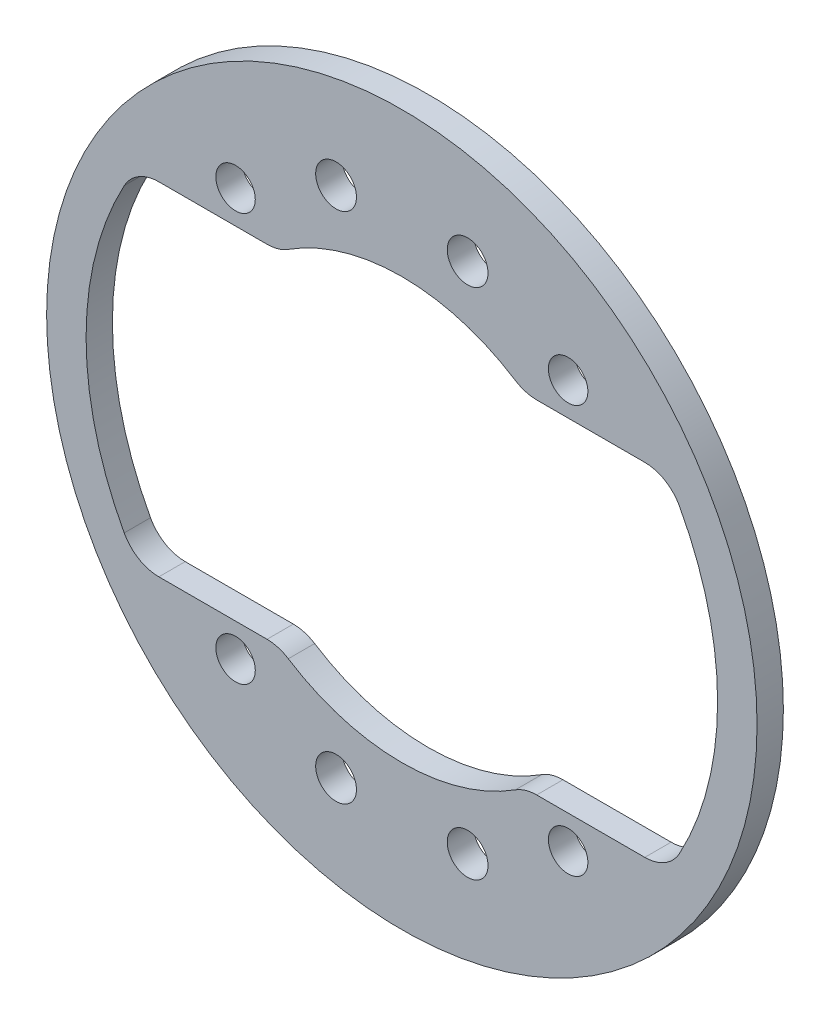
ISO-10303-21;
HEADER;
FILE_DESCRIPTION(('STEP AP214'),'2;1');
FILE_NAME('part.step','',(''),(''),'','','');
FILE_SCHEMA(('AUTOMOTIVE_DESIGN { 1 0 10303 214 1 1 1 1 }'));
ENDSEC;
DATA;
#1=APPLICATION_CONTEXT('core data for automotive mechanical design processes');
#2=APPLICATION_PROTOCOL_DEFINITION('international standard','automotive_design',2000,#1);
#3=PRODUCT_CONTEXT('',#1,'mechanical');
#4=PRODUCT('Part','Part','',(#3));
#5=PRODUCT_RELATED_PRODUCT_CATEGORY('part','',(#4));
#6=PRODUCT_DEFINITION_FORMATION('','',#4);
#7=PRODUCT_DEFINITION_CONTEXT('part definition',#1,'design');
#8=PRODUCT_DEFINITION('design','',#6,#7);
#9=PRODUCT_DEFINITION_SHAPE('','',#8);
#10=(LENGTH_UNIT() NAMED_UNIT(*) SI_UNIT(.MILLI.,.METRE.));
#11=(NAMED_UNIT(*) PLANE_ANGLE_UNIT() SI_UNIT($,.RADIAN.));
#12=(NAMED_UNIT(*) SI_UNIT($,.STERADIAN.) SOLID_ANGLE_UNIT());
#13=UNCERTAINTY_MEASURE_WITH_UNIT(LENGTH_MEASURE(1.E-05),#10,'distance_accuracy_value','');
#14=(GEOMETRIC_REPRESENTATION_CONTEXT(3) GLOBAL_UNCERTAINTY_ASSIGNED_CONTEXT((#13)) GLOBAL_UNIT_ASSIGNED_CONTEXT((#10,
#11,#12)) REPRESENTATION_CONTEXT('',''));
#15=CARTESIAN_POINT('',(0.,0.,0.));
#16=DIRECTION('',(0.,0.,1.));
#17=DIRECTION('',(1.,0.,0.));
#18=AXIS2_PLACEMENT_3D('',#15,#16,#17);
#19=CARTESIAN_POINT('',(0.,0.,1.));
#20=DIRECTION('',(0.,0.,1.));
#21=DIRECTION('',(1.,0.,0.));
#22=AXIS2_PLACEMENT_3D('',#19,#20,#21);
#23=PLANE('',#22);
#24=CARTESIAN_POINT('',(-5.,-19.5,1.));
#25=DIRECTION('',(0.,0.,1.));
#26=DIRECTION('',(1.,0.,0.));
#27=AXIS2_PLACEMENT_3D('',#24,#25,#26);
#28=CIRCLE('',#27,1.55);
#29=CARTESIAN_POINT('',(-3.45,-19.5,1.));
#30=VERTEX_POINT('',#29);
#31=EDGE_CURVE('E593',#30,#30,#28,.T.);
#32=ORIENTED_EDGE('',*,*,#31,.F.);
#33=EDGE_LOOP('',(#32));
#34=FACE_BOUND('',#33,.T.);
#35=CARTESIAN_POINT('',(5.,19.5,1.));
#36=DIRECTION('',(0.,0.,1.));
#37=DIRECTION('',(1.,0.,0.));
#38=AXIS2_PLACEMENT_3D('',#35,#36,#37);
#39=CIRCLE('',#38,1.55);
#40=CARTESIAN_POINT('',(6.55,19.5,1.));
#41=VERTEX_POINT('',#40);
#42=EDGE_CURVE('E595',#41,#41,#39,.T.);
#43=ORIENTED_EDGE('',*,*,#42,.F.);
#44=EDGE_LOOP('',(#43));
#45=FACE_BOUND('',#44,.T.);
#46=CARTESIAN_POINT('',(5.,-19.5,1.));
#47=DIRECTION('',(0.,0.,1.));
#48=DIRECTION('',(1.,0.,0.));
#49=AXIS2_PLACEMENT_3D('',#46,#47,#48);
#50=CIRCLE('',#49,1.55);
#51=CARTESIAN_POINT('',(6.55,-19.5,1.));
#52=VERTEX_POINT('',#51);
#53=EDGE_CURVE('E606',#52,#52,#50,.T.);
#54=ORIENTED_EDGE('',*,*,#53,.F.);
#55=EDGE_LOOP('',(#54));
#56=FACE_BOUND('',#55,.T.);
#57=CARTESIAN_POINT('',(-5.,19.5,1.));
#58=DIRECTION('',(0.,0.,1.));
#59=DIRECTION('',(1.,0.,0.));
#60=AXIS2_PLACEMENT_3D('',#57,#58,#59);
#61=CIRCLE('',#60,1.55);
#62=CARTESIAN_POINT('',(-3.45,19.5,1.));
#63=VERTEX_POINT('',#62);
#64=EDGE_CURVE('E373',#63,#63,#61,.T.);
#65=ORIENTED_EDGE('',*,*,#64,.F.);
#66=EDGE_LOOP('',(#65));
#67=FACE_BOUND('',#66,.T.);
#68=CARTESIAN_POINT('',(-12.6392246597645,-15.5,1.));
#69=DIRECTION('',(0.,0.,1.));
#70=DIRECTION('',(1.,0.,0.));
#71=AXIS2_PLACEMENT_3D('',#68,#69,#70);
#72=CIRCLE('',#71,1.5);
#73=CARTESIAN_POINT('',(-11.1392246597645,-15.5,1.));
#74=VERTEX_POINT('',#73);
#75=EDGE_CURVE('E290',#74,#74,#72,.T.);
#76=ORIENTED_EDGE('',*,*,#75,.F.);
#77=EDGE_LOOP('',(#76));
#78=FACE_BOUND('',#77,.T.);
#79=CARTESIAN_POINT('',(-12.6392246597645,15.5,1.));
#80=DIRECTION('',(0.,0.,1.));
#81=DIRECTION('',(1.,0.,0.));
#82=AXIS2_PLACEMENT_3D('',#79,#80,#81);
#83=CIRCLE('',#82,1.5);
#84=CARTESIAN_POINT('',(-11.1392246597645,15.5,1.));
#85=VERTEX_POINT('',#84);
#86=EDGE_CURVE('E302',#85,#85,#83,.T.);
#87=ORIENTED_EDGE('',*,*,#86,.F.);
#88=EDGE_LOOP('',(#87));
#89=FACE_BOUND('',#88,.T.);
#90=CARTESIAN_POINT('',(0.,0.,1.));
#91=DIRECTION('',(0.,0.,1.));
#92=DIRECTION('',(1.,0.,0.));
#93=AXIS2_PLACEMENT_3D('',#90,#91,#92);
#94=CIRCLE('',#93,27.);
#95=CARTESIAN_POINT('',(27.,0.,1.));
#96=VERTEX_POINT('',#95);
#97=EDGE_CURVE('E175',#96,#96,#94,.T.);
#98=ORIENTED_EDGE('',*,*,#97,.T.);
#99=EDGE_LOOP('',(#98));
#100=FACE_BOUND('',#99,.T.);
#101=CARTESIAN_POINT('',(12.6392246597645,15.5,1.));
#102=DIRECTION('',(0.,0.,1.));
#103=DIRECTION('',(1.,0.,0.));
#104=AXIS2_PLACEMENT_3D('',#101,#102,#103);
#105=CIRCLE('',#104,1.5);
#106=CARTESIAN_POINT('',(14.1392246597645,15.5,1.));
#107=VERTEX_POINT('',#106);
#108=EDGE_CURVE('E296',#107,#107,#105,.T.);
#109=ORIENTED_EDGE('',*,*,#108,.F.);
#110=EDGE_LOOP('',(#109));
#111=FACE_BOUND('',#110,.T.);
#112=CARTESIAN_POINT('',(12.6392246597645,-15.5,1.));
#113=DIRECTION('',(0.,0.,1.));
#114=DIRECTION('',(1.,0.,0.));
#115=AXIS2_PLACEMENT_3D('',#112,#113,#114);
#116=CIRCLE('',#115,1.5);
#117=CARTESIAN_POINT('',(14.1392246597645,-15.5,1.));
#118=VERTEX_POINT('',#117);
#119=EDGE_CURVE('E267',#118,#118,#116,.T.);
#120=ORIENTED_EDGE('',*,*,#119,.F.);
#121=EDGE_LOOP('',(#120));
#122=FACE_BOUND('',#121,.T.);
#123=DIRECTION('',(1.,0.,0.));
#124=VECTOR('',#123,1.);
#125=CARTESIAN_POINT('',(9.32737905308881,-13.,1.));
#126=LINE('',#125,#124);
#127=CARTESIAN_POINT('',(10.2469507659596,-13.,1.));
#128=VERTEX_POINT('',#127);
#129=CARTESIAN_POINT('',(18.4661853126194,-13.,1.));
#130=VERTEX_POINT('',#129);
#131=EDGE_CURVE('E377',#128,#130,#126,.T.);
#132=ORIENTED_EDGE('',*,*,#131,.F.);
#133=CARTESIAN_POINT('',(10.2469507659596,-16.,1.));
#134=DIRECTION('',(0.,0.,1.));
#135=DIRECTION('',(1.,0.,0.));
#136=AXIS2_PLACEMENT_3D('',#133,#134,#135);
#137=CIRCLE('',#136,3.);
#138=CARTESIAN_POINT('',(8.62901117133439,-13.4736842105263,1.));
#139=VERTEX_POINT('',#138);
#140=EDGE_CURVE('E197',#128,#139,#137,.T.);
#141=ORIENTED_EDGE('',*,*,#140,.T.);
#142=CARTESIAN_POINT('',(0.,0.,1.));
#143=DIRECTION('',(0.,0.,1.));
#144=DIRECTION('',(1.,0.,0.));
#145=AXIS2_PLACEMENT_3D('',#142,#143,#144);
#146=CIRCLE('',#145,16.);
#147=CARTESIAN_POINT('',(-8.62901117133439,-13.4736842105263,1.));
#148=VERTEX_POINT('',#147);
#149=EDGE_CURVE('E370',#148,#139,#146,.T.);
#150=ORIENTED_EDGE('',*,*,#149,.F.);
#151=CARTESIAN_POINT('',(-10.2469507659596,-16.,1.));
#152=DIRECTION('',(0.,0.,1.));
#153=DIRECTION('',(1.,0.,0.));
#154=AXIS2_PLACEMENT_3D('',#151,#152,#153);
#155=CIRCLE('',#154,3.);
#156=CARTESIAN_POINT('',(-10.2469507659596,-13.,1.));
#157=VERTEX_POINT('',#156);
#158=EDGE_CURVE('E174',#148,#157,#155,.T.);
#159=ORIENTED_EDGE('',*,*,#158,.T.);
#160=DIRECTION('',(1.,0.,0.));
#161=VECTOR('',#160,1.);
#162=CARTESIAN_POINT('',(-20.174241001832,-13.,1.));
#163=LINE('',#162,#161);
#164=CARTESIAN_POINT('',(-18.4661853126194,-13.,1.));
#165=VERTEX_POINT('',#164);
#166=EDGE_CURVE('E368',#165,#157,#163,.T.);
#167=ORIENTED_EDGE('',*,*,#166,.F.);
#168=CARTESIAN_POINT('',(-18.4661853126194,-10.,1.));
#169=DIRECTION('',(0.,0.,1.));
#170=DIRECTION('',(1.,0.,0.));
#171=AXIS2_PLACEMENT_3D('',#168,#169,#170);
#172=CIRCLE('',#171,3.);
#173=CARTESIAN_POINT('',(-21.1042117858507,-11.4285714285714,1.));
#174=VERTEX_POINT('',#173);
#175=EDGE_CURVE('E236',#165,#174,#172,.F.);
#176=ORIENTED_EDGE('',*,*,#175,.T.);
#177=CARTESIAN_POINT('',(0.,0.,1.));
#178=DIRECTION('',(0.,0.,1.));
#179=DIRECTION('',(1.,0.,0.));
#180=AXIS2_PLACEMENT_3D('',#177,#178,#179);
#181=CIRCLE('',#180,24.0000000000001);
#182=CARTESIAN_POINT('',(-21.1042117858507,11.4285714285714,1.));
#183=VERTEX_POINT('',#182);
#184=EDGE_CURVE('E259',#183,#174,#181,.T.);
#185=ORIENTED_EDGE('',*,*,#184,.F.);
#186=CARTESIAN_POINT('',(-18.4661853126194,10.,1.));
#187=DIRECTION('',(0.,0.,1.));
#188=DIRECTION('',(1.,0.,0.));
#189=AXIS2_PLACEMENT_3D('',#186,#187,#188);
#190=CIRCLE('',#189,3.);
#191=CARTESIAN_POINT('',(-18.4661853126194,13.,1.));
#192=VERTEX_POINT('',#191);
#193=EDGE_CURVE('E11',#183,#192,#190,.F.);
#194=ORIENTED_EDGE('',*,*,#193,.T.);
#195=DIRECTION('',(-1.,0.,0.));
#196=VECTOR('',#195,1.);
#197=CARTESIAN_POINT('',(-20.174241001832,13.,1.));
#198=LINE('',#197,#196);
#199=CARTESIAN_POINT('',(-10.2469507659596,13.,1.));
#200=VERTEX_POINT('',#199);
#201=EDGE_CURVE('E257',#200,#192,#198,.T.);
#202=ORIENTED_EDGE('',*,*,#201,.F.);
#203=CARTESIAN_POINT('',(-10.2469507659596,16.,1.));
#204=DIRECTION('',(0.,0.,1.));
#205=DIRECTION('',(1.,0.,0.));
#206=AXIS2_PLACEMENT_3D('',#203,#204,#205);
#207=CIRCLE('',#206,3.);
#208=CARTESIAN_POINT('',(-8.62901117133439,13.4736842105263,1.));
#209=VERTEX_POINT('',#208);
#210=EDGE_CURVE('E194',#200,#209,#207,.T.);
#211=ORIENTED_EDGE('',*,*,#210,.T.);
#212=CARTESIAN_POINT('',(0.,0.,1.));
#213=DIRECTION('',(0.,0.,1.));
#214=DIRECTION('',(1.,0.,0.));
#215=AXIS2_PLACEMENT_3D('',#212,#213,#214);
#216=CIRCLE('',#215,16.);
#217=CARTESIAN_POINT('',(8.62901117133439,13.4736842105263,1.));
#218=VERTEX_POINT('',#217);
#219=EDGE_CURVE('E264',#218,#209,#216,.T.);
#220=ORIENTED_EDGE('',*,*,#219,.F.);
#221=CARTESIAN_POINT('',(10.2469507659596,16.,1.));
#222=DIRECTION('',(0.,0.,1.));
#223=DIRECTION('',(1.,0.,0.));
#224=AXIS2_PLACEMENT_3D('',#221,#222,#223);
#225=CIRCLE('',#224,3.);
#226=CARTESIAN_POINT('',(10.2469507659596,13.,1.));
#227=VERTEX_POINT('',#226);
#228=EDGE_CURVE('E192',#218,#227,#225,.T.);
#229=ORIENTED_EDGE('',*,*,#228,.T.);
#230=DIRECTION('',(-1.,0.,0.));
#231=VECTOR('',#230,1.);
#232=CARTESIAN_POINT('',(9.32737905308881,13.,1.));
#233=LINE('',#232,#231);
#234=CARTESIAN_POINT('',(18.4661853126194,13.,1.));
#235=VERTEX_POINT('',#234);
#236=EDGE_CURVE('E270',#235,#227,#233,.T.);
#237=ORIENTED_EDGE('',*,*,#236,.F.);
#238=CARTESIAN_POINT('',(18.4661853126194,10.,1.));
#239=DIRECTION('',(0.,0.,1.));
#240=DIRECTION('',(1.,0.,0.));
#241=AXIS2_PLACEMENT_3D('',#238,#239,#240);
#242=CIRCLE('',#241,3.);
#243=CARTESIAN_POINT('',(21.1042117858507,11.4285714285714,1.));
#244=VERTEX_POINT('',#243);
#245=EDGE_CURVE('E50',#235,#244,#242,.F.);
#246=ORIENTED_EDGE('',*,*,#245,.T.);
#247=CARTESIAN_POINT('',(0.,0.,1.));
#248=DIRECTION('',(0.,0.,1.));
#249=DIRECTION('',(-1.,0.,0.));
#250=AXIS2_PLACEMENT_3D('',#247,#248,#249);
#251=CIRCLE('',#250,24.);
#252=CARTESIAN_POINT('',(21.1042117858507,-11.4285714285714,1.));
#253=VERTEX_POINT('',#252);
#254=EDGE_CURVE('E380',#253,#244,#251,.T.);
#255=ORIENTED_EDGE('',*,*,#254,.F.);
#256=CARTESIAN_POINT('',(18.4661853126194,-10.,1.));
#257=DIRECTION('',(0.,0.,1.));
#258=DIRECTION('',(1.,0.,0.));
#259=AXIS2_PLACEMENT_3D('',#256,#257,#258);
#260=CIRCLE('',#259,3.);
#261=EDGE_CURVE('E232',#253,#130,#260,.F.);
#262=ORIENTED_EDGE('',*,*,#261,.T.);
#263=EDGE_LOOP('',(#132,#141,#150,#159,#167,#176,#185,#194,#202,#211,#220,#229,#237,#246,#255,#262));
#264=FACE_BOUND('',#263,.T.);
#265=ADVANCED_FACE('F35',(#34,#45,#56,#67,#78,#89,#100,#111,#122,#264),#23,.T.);
#266=CARTESIAN_POINT('',(0.,0.,-1.));
#267=DIRECTION('',(0.,0.,1.));
#268=DIRECTION('',(1.,0.,0.));
#269=AXIS2_PLACEMENT_3D('',#266,#267,#268);
#270=PLANE('',#269);
#271=CARTESIAN_POINT('',(-5.,-19.5,-1.));
#272=DIRECTION('',(0.,0.,1.));
#273=DIRECTION('',(1.,0.,0.));
#274=AXIS2_PLACEMENT_3D('',#271,#272,#273);
#275=CIRCLE('',#274,1.55);
#276=CARTESIAN_POINT('',(-3.45,-19.5,-1.));
#277=VERTEX_POINT('',#276);
#278=EDGE_CURVE('E591',#277,#277,#275,.T.);
#279=ORIENTED_EDGE('',*,*,#278,.T.);
#280=EDGE_LOOP('',(#279));
#281=FACE_BOUND('',#280,.T.);
#282=CARTESIAN_POINT('',(5.,19.5,-1.));
#283=DIRECTION('',(0.,0.,1.));
#284=DIRECTION('',(1.,0.,0.));
#285=AXIS2_PLACEMENT_3D('',#282,#283,#284);
#286=CIRCLE('',#285,1.55);
#287=CARTESIAN_POINT('',(6.55,19.5,-1.));
#288=VERTEX_POINT('',#287);
#289=EDGE_CURVE('E611',#288,#288,#286,.T.);
#290=ORIENTED_EDGE('',*,*,#289,.T.);
#291=EDGE_LOOP('',(#290));
#292=FACE_BOUND('',#291,.T.);
#293=CARTESIAN_POINT('',(5.,-19.5,-1.));
#294=DIRECTION('',(0.,0.,1.));
#295=DIRECTION('',(1.,0.,0.));
#296=AXIS2_PLACEMENT_3D('',#293,#294,#295);
#297=CIRCLE('',#296,1.55);
#298=CARTESIAN_POINT('',(6.55,-19.5,-1.));
#299=VERTEX_POINT('',#298);
#300=EDGE_CURVE('E602',#299,#299,#297,.T.);
#301=ORIENTED_EDGE('',*,*,#300,.T.);
#302=EDGE_LOOP('',(#301));
#303=FACE_BOUND('',#302,.T.);
#304=CARTESIAN_POINT('',(-5.,19.5,-1.));
#305=DIRECTION('',(0.,0.,1.));
#306=DIRECTION('',(1.,0.,0.));
#307=AXIS2_PLACEMENT_3D('',#304,#305,#306);
#308=CIRCLE('',#307,1.55);
#309=CARTESIAN_POINT('',(-3.45,19.5,-1.));
#310=VERTEX_POINT('',#309);
#311=EDGE_CURVE('E251',#310,#310,#308,.T.);
#312=ORIENTED_EDGE('',*,*,#311,.T.);
#313=EDGE_LOOP('',(#312));
#314=FACE_BOUND('',#313,.T.);
#315=CARTESIAN_POINT('',(12.6392246597645,-15.5,-1.));
#316=DIRECTION('',(0.,0.,1.));
#317=DIRECTION('',(1.,0.,0.));
#318=AXIS2_PLACEMENT_3D('',#315,#316,#317);
#319=CIRCLE('',#318,1.5);
#320=CARTESIAN_POINT('',(14.1392246597645,-15.5,-1.));
#321=VERTEX_POINT('',#320);
#322=EDGE_CURVE('E263',#321,#321,#319,.T.);
#323=ORIENTED_EDGE('',*,*,#322,.T.);
#324=EDGE_LOOP('',(#323));
#325=FACE_BOUND('',#324,.T.);
#326=CARTESIAN_POINT('',(-12.6392246597645,-15.5,-1.));
#327=DIRECTION('',(0.,0.,1.));
#328=DIRECTION('',(1.,0.,0.));
#329=AXIS2_PLACEMENT_3D('',#326,#327,#328);
#330=CIRCLE('',#329,1.5);
#331=CARTESIAN_POINT('',(-11.1392246597645,-15.5,-1.));
#332=VERTEX_POINT('',#331);
#333=EDGE_CURVE('E288',#332,#332,#330,.T.);
#334=ORIENTED_EDGE('',*,*,#333,.T.);
#335=EDGE_LOOP('',(#334));
#336=FACE_BOUND('',#335,.T.);
#337=CARTESIAN_POINT('',(12.6392246597645,15.5,-1.));
#338=DIRECTION('',(0.,0.,1.));
#339=DIRECTION('',(1.,0.,0.));
#340=AXIS2_PLACEMENT_3D('',#337,#338,#339);
#341=CIRCLE('',#340,1.5);
#342=CARTESIAN_POINT('',(14.1392246597645,15.5,-1.));
#343=VERTEX_POINT('',#342);
#344=EDGE_CURVE('E293',#343,#343,#341,.T.);
#345=ORIENTED_EDGE('',*,*,#344,.T.);
#346=EDGE_LOOP('',(#345));
#347=FACE_BOUND('',#346,.T.);
#348=CARTESIAN_POINT('',(-12.6392246597645,15.5,-1.));
#349=DIRECTION('',(0.,0.,1.));
#350=DIRECTION('',(1.,0.,0.));
#351=AXIS2_PLACEMENT_3D('',#348,#349,#350);
#352=CIRCLE('',#351,1.5);
#353=CARTESIAN_POINT('',(-11.1392246597645,15.5,-1.));
#354=VERTEX_POINT('',#353);
#355=EDGE_CURVE('E299',#354,#354,#352,.T.);
#356=ORIENTED_EDGE('',*,*,#355,.T.);
#357=EDGE_LOOP('',(#356));
#358=FACE_BOUND('',#357,.T.);
#359=CARTESIAN_POINT('',(0.,0.,-1.));
#360=DIRECTION('',(0.,0.,1.));
#361=DIRECTION('',(1.,0.,0.));
#362=AXIS2_PLACEMENT_3D('',#359,#360,#361);
#363=CIRCLE('',#362,27.);
#364=CARTESIAN_POINT('',(27.,0.,-1.));
#365=VERTEX_POINT('',#364);
#366=EDGE_CURVE('E180',#365,#365,#363,.T.);
#367=ORIENTED_EDGE('',*,*,#366,.F.);
#368=EDGE_LOOP('',(#367));
#369=FACE_BOUND('',#368,.T.);
#370=CARTESIAN_POINT('',(0.,0.,-1.));
#371=DIRECTION('',(0.,0.,1.));
#372=DIRECTION('',(1.,0.,0.));
#373=AXIS2_PLACEMENT_3D('',#370,#371,#372);
#374=CIRCLE('',#373,16.);
#375=CARTESIAN_POINT('',(-8.62901117133439,-13.4736842105263,-1.));
#376=VERTEX_POINT('',#375);
#377=CARTESIAN_POINT('',(8.62901117133439,-13.4736842105263,-1.));
#378=VERTEX_POINT('',#377);
#379=EDGE_CURVE('E152',#376,#378,#374,.T.);
#380=ORIENTED_EDGE('',*,*,#379,.T.);
#381=CARTESIAN_POINT('',(10.2469507659596,-16.,-1.));
#382=DIRECTION('',(0.,0.,1.));
#383=DIRECTION('',(1.,0.,0.));
#384=AXIS2_PLACEMENT_3D('',#381,#382,#383);
#385=CIRCLE('',#384,3.);
#386=CARTESIAN_POINT('',(10.2469507659596,-13.,-1.));
#387=VERTEX_POINT('',#386);
#388=EDGE_CURVE('E159',#378,#387,#385,.F.);
#389=ORIENTED_EDGE('',*,*,#388,.T.);
#390=DIRECTION('',(1.,0.,0.));
#391=VECTOR('',#390,1.);
#392=CARTESIAN_POINT('',(9.32737905308881,-13.,-1.));
#393=LINE('',#392,#391);
#394=CARTESIAN_POINT('',(18.4661853126194,-13.,-1.));
#395=VERTEX_POINT('',#394);
#396=EDGE_CURVE('E170',#387,#395,#393,.T.);
#397=ORIENTED_EDGE('',*,*,#396,.T.);
#398=CARTESIAN_POINT('',(18.4661853126194,-10.,-1.));
#399=DIRECTION('',(0.,0.,1.));
#400=DIRECTION('',(1.,0.,0.));
#401=AXIS2_PLACEMENT_3D('',#398,#399,#400);
#402=CIRCLE('',#401,3.);
#403=CARTESIAN_POINT('',(21.1042117858507,-11.4285714285714,-1.));
#404=VERTEX_POINT('',#403);
#405=EDGE_CURVE('E230',#395,#404,#402,.T.);
#406=ORIENTED_EDGE('',*,*,#405,.T.);
#407=CARTESIAN_POINT('',(0.,0.,-1.));
#408=DIRECTION('',(0.,0.,1.));
#409=DIRECTION('',(-1.,0.,0.));
#410=AXIS2_PLACEMENT_3D('',#407,#408,#409);
#411=CIRCLE('',#410,24.);
#412=CARTESIAN_POINT('',(21.1042117858507,11.4285714285714,-1.));
#413=VERTEX_POINT('',#412);
#414=EDGE_CURVE('E277',#404,#413,#411,.T.);
#415=ORIENTED_EDGE('',*,*,#414,.T.);
#416=CARTESIAN_POINT('',(18.4661853126194,10.,-1.));
#417=DIRECTION('',(0.,0.,1.));
#418=DIRECTION('',(1.,0.,0.));
#419=AXIS2_PLACEMENT_3D('',#416,#417,#418);
#420=CIRCLE('',#419,3.);
#421=CARTESIAN_POINT('',(18.4661853126194,13.,-1.));
#422=VERTEX_POINT('',#421);
#423=EDGE_CURVE('E227',#413,#422,#420,.T.);
#424=ORIENTED_EDGE('',*,*,#423,.T.);
#425=DIRECTION('',(-1.,0.,0.));
#426=VECTOR('',#425,1.);
#427=CARTESIAN_POINT('',(9.32737905308881,13.,-1.));
#428=LINE('',#427,#426);
#429=CARTESIAN_POINT('',(10.2469507659596,13.,-1.));
#430=VERTEX_POINT('',#429);
#431=EDGE_CURVE('E280',#422,#430,#428,.T.);
#432=ORIENTED_EDGE('',*,*,#431,.T.);
#433=CARTESIAN_POINT('',(10.2469507659596,16.,-1.));
#434=DIRECTION('',(0.,0.,1.));
#435=DIRECTION('',(1.,0.,0.));
#436=AXIS2_PLACEMENT_3D('',#433,#434,#435);
#437=CIRCLE('',#436,3.);
#438=CARTESIAN_POINT('',(8.62901117133439,13.4736842105263,-1.));
#439=VERTEX_POINT('',#438);
#440=EDGE_CURVE('E177',#430,#439,#437,.F.);
#441=ORIENTED_EDGE('',*,*,#440,.T.);
#442=CARTESIAN_POINT('',(0.,0.,-1.));
#443=DIRECTION('',(0.,0.,1.));
#444=DIRECTION('',(1.,0.,0.));
#445=AXIS2_PLACEMENT_3D('',#442,#443,#444);
#446=CIRCLE('',#445,16.);
#447=CARTESIAN_POINT('',(-8.62901117133439,13.4736842105263,-1.));
#448=VERTEX_POINT('',#447);
#449=EDGE_CURVE('E283',#439,#448,#446,.T.);
#450=ORIENTED_EDGE('',*,*,#449,.T.);
#451=CARTESIAN_POINT('',(-10.2469507659596,16.,-1.));
#452=DIRECTION('',(0.,0.,1.));
#453=DIRECTION('',(1.,0.,0.));
#454=AXIS2_PLACEMENT_3D('',#451,#452,#453);
#455=CIRCLE('',#454,3.);
#456=CARTESIAN_POINT('',(-10.2469507659596,13.,-1.));
#457=VERTEX_POINT('',#456);
#458=EDGE_CURVE('E160',#448,#457,#455,.F.);
#459=ORIENTED_EDGE('',*,*,#458,.T.);
#460=DIRECTION('',(-1.,0.,0.));
#461=VECTOR('',#460,1.);
#462=CARTESIAN_POINT('',(-20.174241001832,13.,-1.));
#463=LINE('',#462,#461);
#464=CARTESIAN_POINT('',(-18.4661853126194,13.,-1.));
#465=VERTEX_POINT('',#464);
#466=EDGE_CURVE('E242',#457,#465,#463,.T.);
#467=ORIENTED_EDGE('',*,*,#466,.T.);
#468=CARTESIAN_POINT('',(-18.4661853126194,10.,-1.));
#469=DIRECTION('',(0.,0.,1.));
#470=DIRECTION('',(1.,0.,0.));
#471=AXIS2_PLACEMENT_3D('',#468,#469,#470);
#472=CIRCLE('',#471,3.);
#473=CARTESIAN_POINT('',(-21.1042117858507,11.4285714285714,-1.));
#474=VERTEX_POINT('',#473);
#475=EDGE_CURVE('E43',#465,#474,#472,.T.);
#476=ORIENTED_EDGE('',*,*,#475,.T.);
#477=CARTESIAN_POINT('',(0.,0.,-1.));
#478=DIRECTION('',(0.,0.,1.));
#479=DIRECTION('',(1.,0.,0.));
#480=AXIS2_PLACEMENT_3D('',#477,#478,#479);
#481=CIRCLE('',#480,24.0000000000001);
#482=CARTESIAN_POINT('',(-21.1042117858507,-11.4285714285714,-1.));
#483=VERTEX_POINT('',#482);
#484=EDGE_CURVE('E240',#474,#483,#481,.T.);
#485=ORIENTED_EDGE('',*,*,#484,.T.);
#486=CARTESIAN_POINT('',(-18.4661853126194,-10.,-1.));
#487=DIRECTION('',(0.,0.,1.));
#488=DIRECTION('',(1.,0.,0.));
#489=AXIS2_PLACEMENT_3D('',#486,#487,#488);
#490=CIRCLE('',#489,3.);
#491=CARTESIAN_POINT('',(-18.4661853126194,-13.,-1.));
#492=VERTEX_POINT('',#491);
#493=EDGE_CURVE('E234',#483,#492,#490,.T.);
#494=ORIENTED_EDGE('',*,*,#493,.T.);
#495=DIRECTION('',(1.,0.,0.));
#496=VECTOR('',#495,1.);
#497=CARTESIAN_POINT('',(-20.174241001832,-13.,-1.));
#498=LINE('',#497,#496);
#499=CARTESIAN_POINT('',(-10.2469507659596,-13.,-1.));
#500=VERTEX_POINT('',#499);
#501=EDGE_CURVE('E154',#492,#500,#498,.T.);
#502=ORIENTED_EDGE('',*,*,#501,.T.);
#503=CARTESIAN_POINT('',(-10.2469507659596,-16.,-1.));
#504=DIRECTION('',(0.,0.,1.));
#505=DIRECTION('',(1.,0.,0.));
#506=AXIS2_PLACEMENT_3D('',#503,#504,#505);
#507=CIRCLE('',#506,3.);
#508=EDGE_CURVE('E149',#500,#376,#507,.F.);
#509=ORIENTED_EDGE('',*,*,#508,.T.);
#510=EDGE_LOOP('',(#380,#389,#397,#406,#415,#424,#432,#441,#450,#459,#467,#476,#485,#494,#502,#509));
#511=FACE_BOUND('',#510,.T.);
#512=ADVANCED_FACE('F151',(#281,#292,#303,#314,#325,#336,#347,#358,#369,#511),#270,.F.);
#513=CARTESIAN_POINT('',(0.,0.,1.));
#514=DIRECTION('',(0.,0.,-1.));
#515=DIRECTION('',(-1.,0.,0.));
#516=AXIS2_PLACEMENT_3D('',#513,#514,#515);
#517=CYLINDRICAL_SURFACE('',#516,27.);
#518=ORIENTED_EDGE('',*,*,#97,.F.);
#519=EDGE_LOOP('',(#518));
#520=FACE_BOUND('',#519,.T.);
#521=ORIENTED_EDGE('',*,*,#366,.T.);
#522=EDGE_LOOP('',(#521));
#523=FACE_BOUND('',#522,.T.);
#524=ADVANCED_FACE('F313',(#520,#523),#517,.T.);
#525=CARTESIAN_POINT('',(-12.6392246597645,15.5,1.));
#526=DIRECTION('',(0.,0.,-1.));
#527=DIRECTION('',(-1.,0.,0.));
#528=AXIS2_PLACEMENT_3D('',#525,#526,#527);
#529=CYLINDRICAL_SURFACE('',#528,1.5);
#530=ORIENTED_EDGE('',*,*,#86,.T.);
#531=EDGE_LOOP('',(#530));
#532=FACE_BOUND('',#531,.T.);
#533=ORIENTED_EDGE('',*,*,#355,.F.);
#534=EDGE_LOOP('',(#533));
#535=FACE_BOUND('',#534,.T.);
#536=ADVANCED_FACE('F310',(#532,#535),#529,.F.);
#537=CARTESIAN_POINT('',(12.6392246597645,15.5,1.));
#538=DIRECTION('',(0.,0.,-1.));
#539=DIRECTION('',(-1.,0.,0.));
#540=AXIS2_PLACEMENT_3D('',#537,#538,#539);
#541=CYLINDRICAL_SURFACE('',#540,1.5);
#542=ORIENTED_EDGE('',*,*,#108,.T.);
#543=EDGE_LOOP('',(#542));
#544=FACE_BOUND('',#543,.T.);
#545=ORIENTED_EDGE('',*,*,#344,.F.);
#546=EDGE_LOOP('',(#545));
#547=FACE_BOUND('',#546,.T.);
#548=ADVANCED_FACE('F312',(#544,#547),#541,.F.);
#549=CARTESIAN_POINT('',(-12.6392246597645,-15.5,1.));
#550=DIRECTION('',(0.,0.,-1.));
#551=DIRECTION('',(-1.,0.,0.));
#552=AXIS2_PLACEMENT_3D('',#549,#550,#551);
#553=CYLINDRICAL_SURFACE('',#552,1.5);
#554=ORIENTED_EDGE('',*,*,#75,.T.);
#555=EDGE_LOOP('',(#554));
#556=FACE_BOUND('',#555,.T.);
#557=ORIENTED_EDGE('',*,*,#333,.F.);
#558=EDGE_LOOP('',(#557));
#559=FACE_BOUND('',#558,.T.);
#560=ADVANCED_FACE('F320',(#556,#559),#553,.F.);
#561=CARTESIAN_POINT('',(12.6392246597645,-15.5,1.));
#562=DIRECTION('',(0.,0.,-1.));
#563=DIRECTION('',(-1.,0.,0.));
#564=AXIS2_PLACEMENT_3D('',#561,#562,#563);
#565=CYLINDRICAL_SURFACE('',#564,1.5);
#566=ORIENTED_EDGE('',*,*,#119,.T.);
#567=EDGE_LOOP('',(#566));
#568=FACE_BOUND('',#567,.T.);
#569=ORIENTED_EDGE('',*,*,#322,.F.);
#570=EDGE_LOOP('',(#569));
#571=FACE_BOUND('',#570,.T.);
#572=ADVANCED_FACE('F419',(#568,#571),#565,.F.);
#573=CARTESIAN_POINT('',(0.,0.,1.));
#574=DIRECTION('',(0.,0.,-1.));
#575=DIRECTION('',(-1.,0.,0.));
#576=AXIS2_PLACEMENT_3D('',#573,#574,#575);
#577=CYLINDRICAL_SURFACE('',#576,24.0000000000001);
#578=ORIENTED_EDGE('',*,*,#184,.T.);
#579=DIRECTION('',(0.,0.,-1.));
#580=VECTOR('',#579,1.);
#581=CARTESIAN_POINT('',(-21.1042117858507,-11.4285714285714,1.));
#582=LINE('',#581,#580);
#583=EDGE_CURVE('E224',#174,#483,#582,.T.);
#584=ORIENTED_EDGE('',*,*,#583,.T.);
#585=ORIENTED_EDGE('',*,*,#484,.F.);
#586=DIRECTION('',(0.,0.,-1.));
#587=VECTOR('',#586,1.);
#588=CARTESIAN_POINT('',(-21.1042117858507,11.4285714285714,1.));
#589=LINE('',#588,#587);
#590=EDGE_CURVE('E222',#474,#183,#589,.F.);
#591=ORIENTED_EDGE('',*,*,#590,.T.);
#592=EDGE_LOOP('',(#578,#584,#585,#591));
#593=FACE_BOUND('',#592,.T.);
#594=ADVANCED_FACE('F248',(#593),#577,.F.);
#595=CARTESIAN_POINT('',(-20.174241001832,-13.,1.));
#596=DIRECTION('',(0.,1.,0.));
#597=DIRECTION('',(0.,0.,1.));
#598=AXIS2_PLACEMENT_3D('',#595,#596,#597);
#599=PLANE('',#598);
#600=ORIENTED_EDGE('',*,*,#166,.T.);
#601=DIRECTION('',(0.,0.,-1.));
#602=VECTOR('',#601,1.);
#603=CARTESIAN_POINT('',(-10.2469507659596,-13.,1.));
#604=LINE('',#603,#602);
#605=EDGE_CURVE('E201',#157,#500,#604,.T.);
#606=ORIENTED_EDGE('',*,*,#605,.T.);
#607=ORIENTED_EDGE('',*,*,#501,.F.);
#608=DIRECTION('',(0.,0.,1.));
#609=VECTOR('',#608,1.);
#610=CARTESIAN_POINT('',(-18.4661853126194,-13.,1.));
#611=LINE('',#610,#609);
#612=EDGE_CURVE('E199',#492,#165,#611,.T.);
#613=ORIENTED_EDGE('',*,*,#612,.T.);
#614=EDGE_LOOP('',(#600,#606,#607,#613));
#615=FACE_BOUND('',#614,.T.);
#616=ADVANCED_FACE('F413',(#615),#599,.T.);
#617=CARTESIAN_POINT('',(0.,0.,1.));
#618=DIRECTION('',(0.,0.,-1.));
#619=DIRECTION('',(-1.,0.,0.));
#620=AXIS2_PLACEMENT_3D('',#617,#618,#619);
#621=CYLINDRICAL_SURFACE('',#620,16.);
#622=ORIENTED_EDGE('',*,*,#149,.T.);
#623=DIRECTION('',(0.,0.,-1.));
#624=VECTOR('',#623,1.);
#625=CARTESIAN_POINT('',(8.62901117133439,-13.4736842105263,1.));
#626=LINE('',#625,#624);
#627=EDGE_CURVE('E169',#139,#378,#626,.T.);
#628=ORIENTED_EDGE('',*,*,#627,.T.);
#629=ORIENTED_EDGE('',*,*,#379,.F.);
#630=DIRECTION('',(0.,0.,-1.));
#631=VECTOR('',#630,1.);
#632=CARTESIAN_POINT('',(-8.62901117133439,-13.4736842105263,1.));
#633=LINE('',#632,#631);
#634=EDGE_CURVE('E166',#376,#148,#633,.F.);
#635=ORIENTED_EDGE('',*,*,#634,.T.);
#636=EDGE_LOOP('',(#622,#628,#629,#635));
#637=FACE_BOUND('',#636,.T.);
#638=ADVANCED_FACE('F165',(#637),#621,.F.);
#639=CARTESIAN_POINT('',(9.32737905308881,-13.,1.));
#640=DIRECTION('',(0.,1.,0.));
#641=DIRECTION('',(0.,0.,1.));
#642=AXIS2_PLACEMENT_3D('',#639,#640,#641);
#643=PLANE('',#642);
#644=ORIENTED_EDGE('',*,*,#396,.F.);
#645=DIRECTION('',(0.,0.,-1.));
#646=VECTOR('',#645,1.);
#647=CARTESIAN_POINT('',(10.2469507659596,-13.,1.));
#648=LINE('',#647,#646);
#649=EDGE_CURVE('E190',#387,#128,#648,.F.);
#650=ORIENTED_EDGE('',*,*,#649,.T.);
#651=ORIENTED_EDGE('',*,*,#131,.T.);
#652=DIRECTION('',(0.,0.,1.));
#653=VECTOR('',#652,1.);
#654=CARTESIAN_POINT('',(18.4661853126194,-13.,-1.));
#655=LINE('',#654,#653);
#656=EDGE_CURVE('E187',#130,#395,#655,.F.);
#657=ORIENTED_EDGE('',*,*,#656,.T.);
#658=EDGE_LOOP('',(#644,#650,#651,#657));
#659=FACE_BOUND('',#658,.T.);
#660=ADVANCED_FACE('F407',(#659),#643,.T.);
#661=CARTESIAN_POINT('',(0.,0.,1.));
#662=DIRECTION('',(0.,0.,-1.));
#663=DIRECTION('',(-1.,0.,0.));
#664=AXIS2_PLACEMENT_3D('',#661,#662,#663);
#665=CYLINDRICAL_SURFACE('',#664,24.);
#666=ORIENTED_EDGE('',*,*,#254,.T.);
#667=DIRECTION('',(0.,0.,-1.));
#668=VECTOR('',#667,1.);
#669=CARTESIAN_POINT('',(21.1042117858507,11.4285714285714,1.));
#670=LINE('',#669,#668);
#671=EDGE_CURVE('E219',#244,#413,#670,.T.);
#672=ORIENTED_EDGE('',*,*,#671,.T.);
#673=ORIENTED_EDGE('',*,*,#414,.F.);
#674=DIRECTION('',(0.,0.,-1.));
#675=VECTOR('',#674,1.);
#676=CARTESIAN_POINT('',(21.1042117858507,-11.4285714285714,1.));
#677=LINE('',#676,#675);
#678=EDGE_CURVE('E57',#404,#253,#677,.F.);
#679=ORIENTED_EDGE('',*,*,#678,.T.);
#680=EDGE_LOOP('',(#666,#672,#673,#679));
#681=FACE_BOUND('',#680,.T.);
#682=ADVANCED_FACE('F401',(#681),#665,.F.);
#683=CARTESIAN_POINT('',(9.32737905308881,13.,1.));
#684=DIRECTION('',(0.,-1.,0.));
#685=DIRECTION('',(0.,0.,-1.));
#686=AXIS2_PLACEMENT_3D('',#683,#684,#685);
#687=PLANE('',#686);
#688=ORIENTED_EDGE('',*,*,#236,.T.);
#689=DIRECTION('',(0.,0.,-1.));
#690=VECTOR('',#689,1.);
#691=CARTESIAN_POINT('',(10.2469507659596,13.,1.));
#692=LINE('',#691,#690);
#693=EDGE_CURVE('E215',#227,#430,#692,.T.);
#694=ORIENTED_EDGE('',*,*,#693,.T.);
#695=ORIENTED_EDGE('',*,*,#431,.F.);
#696=DIRECTION('',(0.,0.,1.));
#697=VECTOR('',#696,1.);
#698=CARTESIAN_POINT('',(18.4661853126194,13.,1.));
#699=LINE('',#698,#697);
#700=EDGE_CURVE('E213',#422,#235,#699,.T.);
#701=ORIENTED_EDGE('',*,*,#700,.T.);
#702=EDGE_LOOP('',(#688,#694,#695,#701));
#703=FACE_BOUND('',#702,.T.);
#704=ADVANCED_FACE('F384',(#703),#687,.T.);
#705=CARTESIAN_POINT('',(0.,0.,1.));
#706=DIRECTION('',(0.,0.,-1.));
#707=DIRECTION('',(-1.,0.,0.));
#708=AXIS2_PLACEMENT_3D('',#705,#706,#707);
#709=CYLINDRICAL_SURFACE('',#708,16.);
#710=ORIENTED_EDGE('',*,*,#219,.T.);
#711=DIRECTION('',(0.,0.,-1.));
#712=VECTOR('',#711,1.);
#713=CARTESIAN_POINT('',(-8.62901117133439,13.4736842105263,1.));
#714=LINE('',#713,#712);
#715=EDGE_CURVE('E205',#209,#448,#714,.T.);
#716=ORIENTED_EDGE('',*,*,#715,.T.);
#717=ORIENTED_EDGE('',*,*,#449,.F.);
#718=DIRECTION('',(0.,0.,-1.));
#719=VECTOR('',#718,1.);
#720=CARTESIAN_POINT('',(8.62901117133439,13.4736842105263,1.));
#721=LINE('',#720,#719);
#722=EDGE_CURVE('E203',#439,#218,#721,.F.);
#723=ORIENTED_EDGE('',*,*,#722,.T.);
#724=EDGE_LOOP('',(#710,#716,#717,#723));
#725=FACE_BOUND('',#724,.T.);
#726=ADVANCED_FACE('F391',(#725),#709,.F.);
#727=CARTESIAN_POINT('',(-20.174241001832,13.,1.));
#728=DIRECTION('',(0.,-1.,0.));
#729=DIRECTION('',(0.,0.,-1.));
#730=AXIS2_PLACEMENT_3D('',#727,#728,#729);
#731=PLANE('',#730);
#732=ORIENTED_EDGE('',*,*,#466,.F.);
#733=DIRECTION('',(0.,0.,-1.));
#734=VECTOR('',#733,1.);
#735=CARTESIAN_POINT('',(-10.2469507659596,13.,1.));
#736=LINE('',#735,#734);
#737=EDGE_CURVE('E211',#457,#200,#736,.F.);
#738=ORIENTED_EDGE('',*,*,#737,.T.);
#739=ORIENTED_EDGE('',*,*,#201,.T.);
#740=DIRECTION('',(0.,0.,1.));
#741=VECTOR('',#740,1.);
#742=CARTESIAN_POINT('',(-18.4661853126194,13.,-1.));
#743=LINE('',#742,#741);
#744=EDGE_CURVE('E208',#192,#465,#743,.F.);
#745=ORIENTED_EDGE('',*,*,#744,.T.);
#746=EDGE_LOOP('',(#732,#738,#739,#745));
#747=FACE_BOUND('',#746,.T.);
#748=ADVANCED_FACE('F261',(#747),#731,.T.);
#749=CARTESIAN_POINT('',(10.2469507659596,-16.,1.));
#750=DIRECTION('',(0.,0.,-1.));
#751=DIRECTION('',(-1.,0.,0.));
#752=AXIS2_PLACEMENT_3D('',#749,#750,#751);
#753=CYLINDRICAL_SURFACE('',#752,3.);
#754=ORIENTED_EDGE('',*,*,#140,.F.);
#755=ORIENTED_EDGE('',*,*,#649,.F.);
#756=ORIENTED_EDGE('',*,*,#388,.F.);
#757=ORIENTED_EDGE('',*,*,#627,.F.);
#758=EDGE_LOOP('',(#754,#755,#756,#757));
#759=FACE_BOUND('',#758,.T.);
#760=ADVANCED_FACE('F336',(#759),#753,.T.);
#761=CARTESIAN_POINT('',(-10.2469507659596,-16.,1.));
#762=DIRECTION('',(0.,0.,-1.));
#763=DIRECTION('',(-1.,0.,0.));
#764=AXIS2_PLACEMENT_3D('',#761,#762,#763);
#765=CYLINDRICAL_SURFACE('',#764,3.);
#766=ORIENTED_EDGE('',*,*,#158,.F.);
#767=ORIENTED_EDGE('',*,*,#634,.F.);
#768=ORIENTED_EDGE('',*,*,#508,.F.);
#769=ORIENTED_EDGE('',*,*,#605,.F.);
#770=EDGE_LOOP('',(#766,#767,#768,#769));
#771=FACE_BOUND('',#770,.T.);
#772=ADVANCED_FACE('F173',(#771),#765,.T.);
#773=CARTESIAN_POINT('',(-10.2469507659596,16.,1.));
#774=DIRECTION('',(0.,0.,-1.));
#775=DIRECTION('',(-1.,0.,0.));
#776=AXIS2_PLACEMENT_3D('',#773,#774,#775);
#777=CYLINDRICAL_SURFACE('',#776,3.);
#778=ORIENTED_EDGE('',*,*,#210,.F.);
#779=ORIENTED_EDGE('',*,*,#737,.F.);
#780=ORIENTED_EDGE('',*,*,#458,.F.);
#781=ORIENTED_EDGE('',*,*,#715,.F.);
#782=EDGE_LOOP('',(#778,#779,#780,#781));
#783=FACE_BOUND('',#782,.T.);
#784=ADVANCED_FACE('F342',(#783),#777,.T.);
#785=CARTESIAN_POINT('',(10.2469507659596,16.,1.));
#786=DIRECTION('',(0.,0.,-1.));
#787=DIRECTION('',(-1.,0.,0.));
#788=AXIS2_PLACEMENT_3D('',#785,#786,#787);
#789=CYLINDRICAL_SURFACE('',#788,3.);
#790=ORIENTED_EDGE('',*,*,#228,.F.);
#791=ORIENTED_EDGE('',*,*,#722,.F.);
#792=ORIENTED_EDGE('',*,*,#440,.F.);
#793=ORIENTED_EDGE('',*,*,#693,.F.);
#794=EDGE_LOOP('',(#790,#791,#792,#793));
#795=FACE_BOUND('',#794,.T.);
#796=ADVANCED_FACE('F345',(#795),#789,.T.);
#797=CARTESIAN_POINT('',(18.4661853126194,10.,1.));
#798=DIRECTION('',(0.,0.,-1.));
#799=DIRECTION('',(-1.,0.,0.));
#800=AXIS2_PLACEMENT_3D('',#797,#798,#799);
#801=CYLINDRICAL_SURFACE('',#800,3.);
#802=ORIENTED_EDGE('',*,*,#245,.F.);
#803=ORIENTED_EDGE('',*,*,#700,.F.);
#804=ORIENTED_EDGE('',*,*,#423,.F.);
#805=ORIENTED_EDGE('',*,*,#671,.F.);
#806=EDGE_LOOP('',(#802,#803,#804,#805));
#807=FACE_BOUND('',#806,.T.);
#808=ADVANCED_FACE('F349',(#807),#801,.F.);
#809=CARTESIAN_POINT('',(18.4661853126194,-10.,1.));
#810=DIRECTION('',(0.,0.,-1.));
#811=DIRECTION('',(-1.,0.,0.));
#812=AXIS2_PLACEMENT_3D('',#809,#810,#811);
#813=CYLINDRICAL_SURFACE('',#812,3.);
#814=ORIENTED_EDGE('',*,*,#261,.F.);
#815=ORIENTED_EDGE('',*,*,#678,.F.);
#816=ORIENTED_EDGE('',*,*,#405,.F.);
#817=ORIENTED_EDGE('',*,*,#656,.F.);
#818=EDGE_LOOP('',(#814,#815,#816,#817));
#819=FACE_BOUND('',#818,.T.);
#820=ADVANCED_FACE('F353',(#819),#813,.F.);
#821=CARTESIAN_POINT('',(-18.4661853126194,-10.,1.));
#822=DIRECTION('',(0.,0.,-1.));
#823=DIRECTION('',(-1.,0.,0.));
#824=AXIS2_PLACEMENT_3D('',#821,#822,#823);
#825=CYLINDRICAL_SURFACE('',#824,3.);
#826=ORIENTED_EDGE('',*,*,#175,.F.);
#827=ORIENTED_EDGE('',*,*,#612,.F.);
#828=ORIENTED_EDGE('',*,*,#493,.F.);
#829=ORIENTED_EDGE('',*,*,#583,.F.);
#830=EDGE_LOOP('',(#826,#827,#828,#829));
#831=FACE_BOUND('',#830,.T.);
#832=ADVANCED_FACE('F356',(#831),#825,.F.);
#833=CARTESIAN_POINT('',(-18.4661853126194,10.,1.));
#834=DIRECTION('',(0.,0.,-1.));
#835=DIRECTION('',(-1.,0.,0.));
#836=AXIS2_PLACEMENT_3D('',#833,#834,#835);
#837=CYLINDRICAL_SURFACE('',#836,3.);
#838=ORIENTED_EDGE('',*,*,#193,.F.);
#839=ORIENTED_EDGE('',*,*,#590,.F.);
#840=ORIENTED_EDGE('',*,*,#475,.F.);
#841=ORIENTED_EDGE('',*,*,#744,.F.);
#842=EDGE_LOOP('',(#838,#839,#840,#841));
#843=FACE_BOUND('',#842,.T.);
#844=ADVANCED_FACE('F37',(#843),#837,.F.);
#845=CARTESIAN_POINT('',(-5.,19.5,-1.));
#846=DIRECTION('',(0.,0.,1.));
#847=DIRECTION('',(1.,0.,0.));
#848=AXIS2_PLACEMENT_3D('',#845,#846,#847);
#849=CYLINDRICAL_SURFACE('',#848,1.55);
#850=ORIENTED_EDGE('',*,*,#311,.F.);
#851=EDGE_LOOP('',(#850));
#852=FACE_BOUND('',#851,.T.);
#853=ORIENTED_EDGE('',*,*,#64,.T.);
#854=EDGE_LOOP('',(#853));
#855=FACE_BOUND('',#854,.T.);
#856=ADVANCED_FACE('F363',(#852,#855),#849,.F.);
#857=CARTESIAN_POINT('',(5.,-19.5,-1.));
#858=DIRECTION('',(0.,0.,1.));
#859=DIRECTION('',(1.,0.,0.));
#860=AXIS2_PLACEMENT_3D('',#857,#858,#859);
#861=CYLINDRICAL_SURFACE('',#860,1.55);
#862=ORIENTED_EDGE('',*,*,#300,.F.);
#863=EDGE_LOOP('',(#862));
#864=FACE_BOUND('',#863,.T.);
#865=ORIENTED_EDGE('',*,*,#53,.T.);
#866=EDGE_LOOP('',(#865));
#867=FACE_BOUND('',#866,.T.);
#868=ADVANCED_FACE('F555',(#864,#867),#861,.F.);
#869=CARTESIAN_POINT('',(5.,19.5,-1.));
#870=DIRECTION('',(0.,0.,1.));
#871=DIRECTION('',(1.,0.,0.));
#872=AXIS2_PLACEMENT_3D('',#869,#870,#871);
#873=CYLINDRICAL_SURFACE('',#872,1.55);
#874=ORIENTED_EDGE('',*,*,#289,.F.);
#875=EDGE_LOOP('',(#874));
#876=FACE_BOUND('',#875,.T.);
#877=ORIENTED_EDGE('',*,*,#42,.T.);
#878=EDGE_LOOP('',(#877));
#879=FACE_BOUND('',#878,.T.);
#880=ADVANCED_FACE('F564',(#876,#879),#873,.F.);
#881=CARTESIAN_POINT('',(-5.,-19.5,-1.));
#882=DIRECTION('',(0.,0.,1.));
#883=DIRECTION('',(1.,0.,0.));
#884=AXIS2_PLACEMENT_3D('',#881,#882,#883);
#885=CYLINDRICAL_SURFACE('',#884,1.55);
#886=ORIENTED_EDGE('',*,*,#278,.F.);
#887=EDGE_LOOP('',(#886));
#888=FACE_BOUND('',#887,.T.);
#889=ORIENTED_EDGE('',*,*,#31,.T.);
#890=EDGE_LOOP('',(#889));
#891=FACE_BOUND('',#890,.T.);
#892=ADVANCED_FACE('F574',(#888,#891),#885,.F.);
#893=CLOSED_SHELL('',(#265,#512,#524,#536,#548,#560,#572,#594,#616,#638,#660,#682,#704,#726,
#748,#760,#772,#784,#796,#808,#820,#832,#844,#856,#868,#880,#892));
#894=MANIFOLD_SOLID_BREP('B2',#893);
#895=ADVANCED_BREP_SHAPE_REPRESENTATION('',(#18,#894),#14);
#896=SHAPE_DEFINITION_REPRESENTATION(#9,#895);
ENDSEC;
END-ISO-10303-21;
